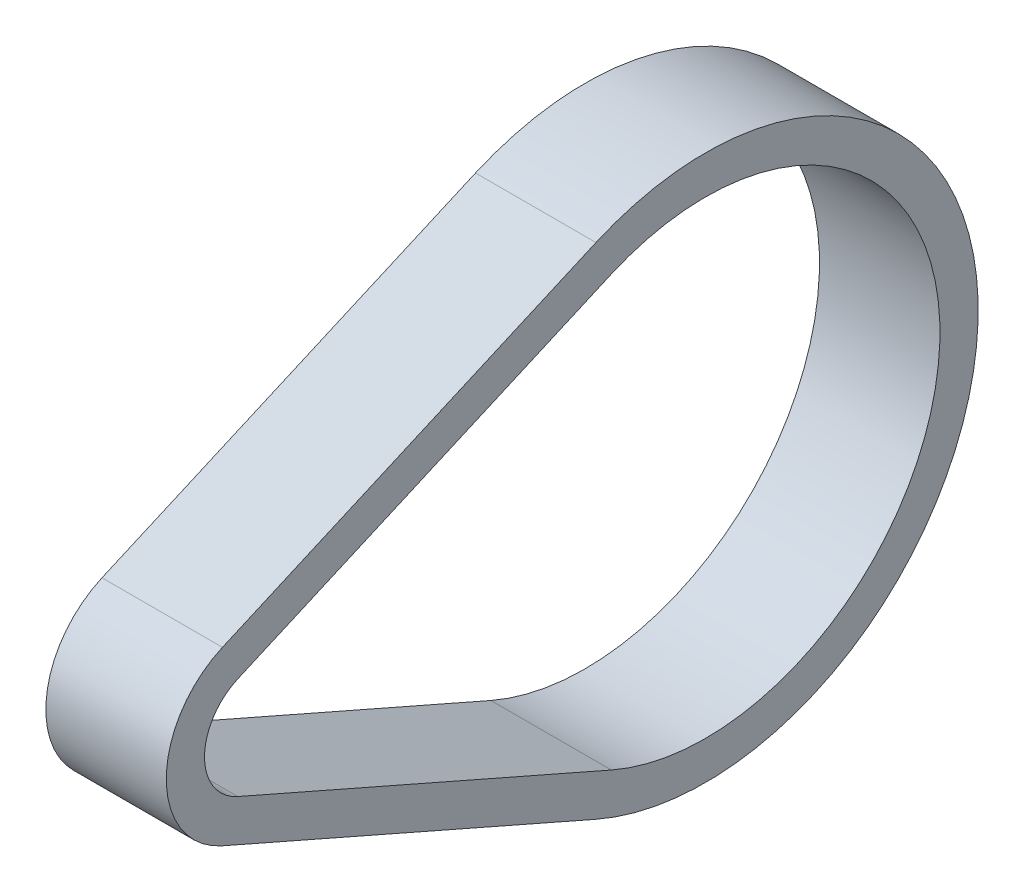
ISO-10303-21;
HEADER;
FILE_DESCRIPTION(('STEP AP214'),'2;1');
FILE_NAME('part.step','',(''),(''),'','','');
FILE_SCHEMA(('AUTOMOTIVE_DESIGN { 1 0 10303 214 1 1 1 1 }'));
ENDSEC;
DATA;
#1=APPLICATION_CONTEXT('core data for automotive mechanical design processes');
#2=APPLICATION_PROTOCOL_DEFINITION('international standard','automotive_design',2000,#1);
#3=PRODUCT_CONTEXT('',#1,'mechanical');
#4=PRODUCT('Part','Part','',(#3));
#5=PRODUCT_RELATED_PRODUCT_CATEGORY('part','',(#4));
#6=PRODUCT_DEFINITION_FORMATION('','',#4);
#7=PRODUCT_DEFINITION_CONTEXT('part definition',#1,'design');
#8=PRODUCT_DEFINITION('design','',#6,#7);
#9=PRODUCT_DEFINITION_SHAPE('','',#8);
#10=(LENGTH_UNIT() NAMED_UNIT(*) SI_UNIT(.MILLI.,.METRE.));
#11=(NAMED_UNIT(*) PLANE_ANGLE_UNIT() SI_UNIT($,.RADIAN.));
#12=(NAMED_UNIT(*) SI_UNIT($,.STERADIAN.) SOLID_ANGLE_UNIT());
#13=UNCERTAINTY_MEASURE_WITH_UNIT(LENGTH_MEASURE(1.E-05),#10,'distance_accuracy_value','');
#14=(GEOMETRIC_REPRESENTATION_CONTEXT(3) GLOBAL_UNCERTAINTY_ASSIGNED_CONTEXT((#13)) GLOBAL_UNIT_ASSIGNED_CONTEXT((#10,
#11,#12)) REPRESENTATION_CONTEXT('',''));
#15=CARTESIAN_POINT('',(0.,0.,0.));
#16=DIRECTION('',(0.,0.,1.));
#17=DIRECTION('',(1.,0.,0.));
#18=AXIS2_PLACEMENT_3D('',#15,#16,#17);
#19=CARTESIAN_POINT('',(7.5,0.,0.));
#20=DIRECTION('',(1.,0.,0.));
#21=DIRECTION('',(0.,0.,-1.));
#22=AXIS2_PLACEMENT_3D('',#19,#20,#21);
#23=PLANE('',#22);
#24=CARTESIAN_POINT('',(7.5,0.,0.));
#25=DIRECTION('',(1.,0.,0.));
#26=DIRECTION('',(0.,0.,-1.));
#27=AXIS2_PLACEMENT_3D('',#24,#25,#26);
#28=CIRCLE('',#27,11.68908);
#29=CARTESIAN_POINT('',(7.5,10.7050218549064,4.69436878955805));
#30=VERTEX_POINT('',#29);
#31=CARTESIAN_POINT('',(7.5,-10.7050218549064,4.69436878955805));
#32=VERTEX_POINT('',#31);
#33=EDGE_CURVE('E153',#30,#32,#28,.T.);
#34=ORIENTED_EDGE('',*,*,#33,.T.);
#35=DIRECTION('',(0.,-0.401602931073964,-0.91581389253101));
#36=VECTOR('',#35,1.);
#37=CARTESIAN_POINT('',(7.5,-10.7050218549064,4.69436878955805));
#38=LINE('',#37,#36);
#39=CARTESIAN_POINT('',(7.5,-31.1031827948616,-41.8215247098695));
#40=VERTEX_POINT('',#39);
#41=EDGE_CURVE('E157',#32,#40,#38,.T.);
#42=ORIENTED_EDGE('',*,*,#41,.T.);
#43=CARTESIAN_POINT('',(7.5,0.,-55.4609));
#44=DIRECTION('',(1.,0.,0.));
#45=DIRECTION('',(0.,0.,-1.));
#46=AXIS2_PLACEMENT_3D('',#43,#44,#45);
#47=CIRCLE('',#46,33.96234);
#48=CARTESIAN_POINT('',(7.5,31.1031827948616,-41.8215247098695));
#49=VERTEX_POINT('',#48);
#50=EDGE_CURVE('E161',#40,#49,#47,.T.);
#51=ORIENTED_EDGE('',*,*,#50,.T.);
#52=DIRECTION('',(0.,-0.401602931073964,0.91581389253101));
#53=VECTOR('',#52,1.);
#54=CARTESIAN_POINT('',(7.5,10.7050218549064,4.69436878955805));
#55=LINE('',#54,#53);
#56=EDGE_CURVE('E164',#49,#30,#55,.T.);
#57=ORIENTED_EDGE('',*,*,#56,.T.);
#58=EDGE_LOOP('',(#34,#42,#51,#57));
#59=FACE_BOUND('',#58,.T.);
#60=DIRECTION('',(0.,-0.401602931073964,-0.915813892531011));
#61=VECTOR('',#60,1.);
#62=CARTESIAN_POINT('',(7.5,-6.34345819172745,2.7817348303183));
#63=LINE('',#62,#61);
#64=CARTESIAN_POINT('',(7.5,-6.34345819172745,2.7817348303183));
#65=VERTEX_POINT('',#64);
#66=CARTESIAN_POINT('',(7.5,-26.7416191316827,-43.7341586691092));
#67=VERTEX_POINT('',#66);
#68=EDGE_CURVE('E114',#65,#67,#63,.T.);
#69=ORIENTED_EDGE('',*,*,#68,.F.);
#70=CARTESIAN_POINT('',(7.5,0.,0.));
#71=DIRECTION('',(1.,0.,0.));
#72=DIRECTION('',(0.,0.,-1.));
#73=AXIS2_PLACEMENT_3D('',#70,#71,#72);
#74=CIRCLE('',#73,6.92658);
#75=CARTESIAN_POINT('',(7.5,6.34345819172745,2.7817348303183));
#76=VERTEX_POINT('',#75);
#77=EDGE_CURVE('E105',#76,#65,#74,.T.);
#78=ORIENTED_EDGE('',*,*,#77,.F.);
#79=DIRECTION('',(0.,-0.401602931073963,0.915813892531011));
#80=VECTOR('',#79,1.);
#81=CARTESIAN_POINT('',(7.5,6.34345819172745,2.7817348303183));
#82=LINE('',#81,#80);
#83=CARTESIAN_POINT('',(7.5,26.7416191316827,-43.7341586691092));
#84=VERTEX_POINT('',#83);
#85=EDGE_CURVE('E131',#84,#76,#82,.T.);
#86=ORIENTED_EDGE('',*,*,#85,.F.);
#87=CARTESIAN_POINT('',(7.5,0.,-55.4609));
#88=DIRECTION('',(1.,0.,0.));
#89=DIRECTION('',(0.,0.,-1.));
#90=AXIS2_PLACEMENT_3D('',#87,#88,#89);
#91=CIRCLE('',#90,29.19984);
#92=EDGE_CURVE('E127',#67,#84,#91,.T.);
#93=ORIENTED_EDGE('',*,*,#92,.F.);
#94=EDGE_LOOP('',(#69,#78,#86,#93));
#95=FACE_BOUND('',#94,.T.);
#96=ADVANCED_FACE('F39',(#59,#95),#23,.T.);
#97=CARTESIAN_POINT('',(-7.5,0.,0.));
#98=DIRECTION('',(1.,0.,0.));
#99=DIRECTION('',(0.,0.,-1.));
#100=AXIS2_PLACEMENT_3D('',#97,#98,#99);
#101=PLANE('',#100);
#102=CARTESIAN_POINT('',(-7.5,0.,0.));
#103=DIRECTION('',(1.,0.,0.));
#104=DIRECTION('',(0.,0.,-1.));
#105=AXIS2_PLACEMENT_3D('',#102,#103,#104);
#106=CIRCLE('',#105,11.68908);
#107=CARTESIAN_POINT('',(-7.5,10.7050218549064,4.69436878955805));
#108=VERTEX_POINT('',#107);
#109=CARTESIAN_POINT('',(-7.5,-10.7050218549064,4.69436878955805));
#110=VERTEX_POINT('',#109);
#111=EDGE_CURVE('E123',#108,#110,#106,.T.);
#112=ORIENTED_EDGE('',*,*,#111,.F.);
#113=DIRECTION('',(0.,-0.401602931073964,0.91581389253101));
#114=VECTOR('',#113,1.);
#115=CARTESIAN_POINT('',(-7.5,10.7050218549064,4.69436878955805));
#116=LINE('',#115,#114);
#117=CARTESIAN_POINT('',(-7.5,31.1031827948616,-41.8215247098695));
#118=VERTEX_POINT('',#117);
#119=EDGE_CURVE('E158',#118,#108,#116,.T.);
#120=ORIENTED_EDGE('',*,*,#119,.F.);
#121=CARTESIAN_POINT('',(-7.5,0.,-55.4609));
#122=DIRECTION('',(1.,0.,0.));
#123=DIRECTION('',(0.,0.,-1.));
#124=AXIS2_PLACEMENT_3D('',#121,#122,#123);
#125=CIRCLE('',#124,33.96234);
#126=CARTESIAN_POINT('',(-7.5,-31.1031827948616,-41.8215247098695));
#127=VERTEX_POINT('',#126);
#128=EDGE_CURVE('E174',#127,#118,#125,.T.);
#129=ORIENTED_EDGE('',*,*,#128,.F.);
#130=DIRECTION('',(0.,-0.401602931073964,-0.91581389253101));
#131=VECTOR('',#130,1.);
#132=CARTESIAN_POINT('',(-7.5,-10.7050218549064,4.69436878955805));
#133=LINE('',#132,#131);
#134=EDGE_CURVE('E171',#110,#127,#133,.T.);
#135=ORIENTED_EDGE('',*,*,#134,.F.);
#136=EDGE_LOOP('',(#112,#120,#129,#135));
#137=FACE_BOUND('',#136,.T.);
#138=CARTESIAN_POINT('',(-7.5,0.,0.));
#139=DIRECTION('',(1.,0.,0.));
#140=DIRECTION('',(0.,0.,-1.));
#141=AXIS2_PLACEMENT_3D('',#138,#139,#140);
#142=CIRCLE('',#141,6.92658);
#143=CARTESIAN_POINT('',(-7.5,6.34345819172745,2.7817348303183));
#144=VERTEX_POINT('',#143);
#145=CARTESIAN_POINT('',(-7.5,-6.34345819172745,2.7817348303183));
#146=VERTEX_POINT('',#145);
#147=EDGE_CURVE('E63',#144,#146,#142,.T.);
#148=ORIENTED_EDGE('',*,*,#147,.T.);
#149=DIRECTION('',(0.,-0.401602931073964,-0.915813892531011));
#150=VECTOR('',#149,1.);
#151=CARTESIAN_POINT('',(-7.5,-6.34345819172745,2.7817348303183));
#152=LINE('',#151,#150);
#153=CARTESIAN_POINT('',(-7.5,-26.7416191316827,-43.7341586691092));
#154=VERTEX_POINT('',#153);
#155=EDGE_CURVE('E121',#146,#154,#152,.T.);
#156=ORIENTED_EDGE('',*,*,#155,.T.);
#157=CARTESIAN_POINT('',(-7.5,0.,-55.4609));
#158=DIRECTION('',(1.,0.,0.));
#159=DIRECTION('',(0.,0.,-1.));
#160=AXIS2_PLACEMENT_3D('',#157,#158,#159);
#161=CIRCLE('',#160,29.19984);
#162=CARTESIAN_POINT('',(-7.5,26.7416191316827,-43.7341586691092));
#163=VERTEX_POINT('',#162);
#164=EDGE_CURVE('E140',#154,#163,#161,.T.);
#165=ORIENTED_EDGE('',*,*,#164,.T.);
#166=DIRECTION('',(0.,-0.401602931073963,0.915813892531011));
#167=VECTOR('',#166,1.);
#168=CARTESIAN_POINT('',(-7.5,6.34345819172745,2.7817348303183));
#169=LINE('',#168,#167);
#170=EDGE_CURVE('E115',#163,#144,#169,.T.);
#171=ORIENTED_EDGE('',*,*,#170,.T.);
#172=EDGE_LOOP('',(#148,#156,#165,#171));
#173=FACE_BOUND('',#172,.T.);
#174=ADVANCED_FACE('F197',(#137,#173),#101,.F.);
#175=CARTESIAN_POINT('',(7.5,0.,0.));
#176=DIRECTION('',(-1.,0.,0.));
#177=DIRECTION('',(0.,0.,1.));
#178=AXIS2_PLACEMENT_3D('',#175,#176,#177);
#179=CYLINDRICAL_SURFACE('',#178,11.68908);
#180=ORIENTED_EDGE('',*,*,#111,.T.);
#181=DIRECTION('',(-1.,0.,0.));
#182=VECTOR('',#181,1.);
#183=CARTESIAN_POINT('',(7.5,-10.7050218549064,4.69436878955805));
#184=LINE('',#183,#182);
#185=EDGE_CURVE('E11',#32,#110,#184,.T.);
#186=ORIENTED_EDGE('',*,*,#185,.F.);
#187=ORIENTED_EDGE('',*,*,#33,.F.);
#188=DIRECTION('',(-1.,0.,0.));
#189=VECTOR('',#188,1.);
#190=CARTESIAN_POINT('',(7.5,10.7050218549064,4.69436878955805));
#191=LINE('',#190,#189);
#192=EDGE_CURVE('E167',#30,#108,#191,.T.);
#193=ORIENTED_EDGE('',*,*,#192,.T.);
#194=EDGE_LOOP('',(#180,#186,#187,#193));
#195=FACE_BOUND('',#194,.T.);
#196=ADVANCED_FACE('F41',(#195),#179,.T.);
#197=CARTESIAN_POINT('',(7.5,-10.7050218549064,4.69436878955805));
#198=DIRECTION('',(0.,0.91581389253101,-0.401602931073964));
#199=DIRECTION('',(0.,0.401602931073964,0.91581389253101));
#200=AXIS2_PLACEMENT_3D('',#197,#198,#199);
#201=PLANE('',#200);
#202=ORIENTED_EDGE('',*,*,#134,.T.);
#203=DIRECTION('',(-1.,0.,0.));
#204=VECTOR('',#203,1.);
#205=CARTESIAN_POINT('',(7.5,-31.1031827948616,-41.8215247098695));
#206=LINE('',#205,#204);
#207=EDGE_CURVE('E48',#40,#127,#206,.T.);
#208=ORIENTED_EDGE('',*,*,#207,.F.);
#209=ORIENTED_EDGE('',*,*,#41,.F.);
#210=ORIENTED_EDGE('',*,*,#185,.T.);
#211=EDGE_LOOP('',(#202,#208,#209,#210));
#212=FACE_BOUND('',#211,.T.);
#213=ADVANCED_FACE('F207',(#212),#201,.F.);
#214=CARTESIAN_POINT('',(7.5,0.,-55.4609));
#215=DIRECTION('',(-1.,0.,0.));
#216=DIRECTION('',(0.,0.,1.));
#217=AXIS2_PLACEMENT_3D('',#214,#215,#216);
#218=CYLINDRICAL_SURFACE('',#217,33.96234);
#219=ORIENTED_EDGE('',*,*,#128,.T.);
#220=DIRECTION('',(-1.,0.,0.));
#221=VECTOR('',#220,1.);
#222=CARTESIAN_POINT('',(7.5,31.1031827948616,-41.8215247098695));
#223=LINE('',#222,#221);
#224=EDGE_CURVE('E182',#49,#118,#223,.T.);
#225=ORIENTED_EDGE('',*,*,#224,.F.);
#226=ORIENTED_EDGE('',*,*,#50,.F.);
#227=ORIENTED_EDGE('',*,*,#207,.T.);
#228=EDGE_LOOP('',(#219,#225,#226,#227));
#229=FACE_BOUND('',#228,.T.);
#230=ADVANCED_FACE('F191',(#229),#218,.T.);
#231=CARTESIAN_POINT('',(7.5,10.7050218549064,4.69436878955805));
#232=DIRECTION('',(0.,-0.91581389253101,-0.401602931073964));
#233=DIRECTION('',(0.,0.401602931073964,-0.91581389253101));
#234=AXIS2_PLACEMENT_3D('',#231,#232,#233);
#235=PLANE('',#234);
#236=ORIENTED_EDGE('',*,*,#119,.T.);
#237=ORIENTED_EDGE('',*,*,#192,.F.);
#238=ORIENTED_EDGE('',*,*,#56,.F.);
#239=ORIENTED_EDGE('',*,*,#224,.T.);
#240=EDGE_LOOP('',(#236,#237,#238,#239));
#241=FACE_BOUND('',#240,.T.);
#242=ADVANCED_FACE('F201',(#241),#235,.F.);
#243=CARTESIAN_POINT('',(7.5,0.,0.));
#244=DIRECTION('',(-1.,0.,0.));
#245=DIRECTION('',(0.,0.,1.));
#246=AXIS2_PLACEMENT_3D('',#243,#244,#245);
#247=CYLINDRICAL_SURFACE('',#246,6.92658);
#248=ORIENTED_EDGE('',*,*,#147,.F.);
#249=DIRECTION('',(-1.,0.,0.));
#250=VECTOR('',#249,1.);
#251=CARTESIAN_POINT('',(7.5,6.34345819172745,2.7817348303183));
#252=LINE('',#251,#250);
#253=EDGE_CURVE('E109',#76,#144,#252,.T.);
#254=ORIENTED_EDGE('',*,*,#253,.F.);
#255=ORIENTED_EDGE('',*,*,#77,.T.);
#256=DIRECTION('',(-1.,0.,0.));
#257=VECTOR('',#256,1.);
#258=CARTESIAN_POINT('',(7.5,-6.34345819172745,2.7817348303183));
#259=LINE('',#258,#257);
#260=EDGE_CURVE('E108',#65,#146,#259,.T.);
#261=ORIENTED_EDGE('',*,*,#260,.T.);
#262=EDGE_LOOP('',(#248,#254,#255,#261));
#263=FACE_BOUND('',#262,.T.);
#264=ADVANCED_FACE('F107',(#263),#247,.F.);
#265=CARTESIAN_POINT('',(7.5,-6.34345819172745,2.7817348303183));
#266=DIRECTION('',(0.,0.91581389253101,-0.401602931073964));
#267=DIRECTION('',(0.,0.401602931073964,0.915813892531011));
#268=AXIS2_PLACEMENT_3D('',#265,#266,#267);
#269=PLANE('',#268);
#270=ORIENTED_EDGE('',*,*,#155,.F.);
#271=ORIENTED_EDGE('',*,*,#260,.F.);
#272=ORIENTED_EDGE('',*,*,#68,.T.);
#273=DIRECTION('',(-1.,0.,0.));
#274=VECTOR('',#273,1.);
#275=CARTESIAN_POINT('',(7.5,-26.7416191316827,-43.7341586691092));
#276=LINE('',#275,#274);
#277=EDGE_CURVE('E124',#67,#154,#276,.T.);
#278=ORIENTED_EDGE('',*,*,#277,.T.);
#279=EDGE_LOOP('',(#270,#271,#272,#278));
#280=FACE_BOUND('',#279,.T.);
#281=ADVANCED_FACE('F118',(#280),#269,.T.);
#282=CARTESIAN_POINT('',(7.5,0.,-55.4609));
#283=DIRECTION('',(-1.,0.,0.));
#284=DIRECTION('',(0.,0.,1.));
#285=AXIS2_PLACEMENT_3D('',#282,#283,#284);
#286=CYLINDRICAL_SURFACE('',#285,29.19984);
#287=ORIENTED_EDGE('',*,*,#164,.F.);
#288=ORIENTED_EDGE('',*,*,#277,.F.);
#289=ORIENTED_EDGE('',*,*,#92,.T.);
#290=DIRECTION('',(-1.,0.,0.));
#291=VECTOR('',#290,1.);
#292=CARTESIAN_POINT('',(7.5,26.7416191316827,-43.7341586691092));
#293=LINE('',#292,#291);
#294=EDGE_CURVE('E55',#84,#163,#293,.T.);
#295=ORIENTED_EDGE('',*,*,#294,.T.);
#296=EDGE_LOOP('',(#287,#288,#289,#295));
#297=FACE_BOUND('',#296,.T.);
#298=ADVANCED_FACE('F230',(#297),#286,.F.);
#299=CARTESIAN_POINT('',(7.5,6.34345819172745,2.7817348303183));
#300=DIRECTION('',(0.,-0.915813892531011,-0.401602931073963));
#301=DIRECTION('',(0.,0.401602931073964,-0.915813892531011));
#302=AXIS2_PLACEMENT_3D('',#299,#300,#301);
#303=PLANE('',#302);
#304=ORIENTED_EDGE('',*,*,#170,.F.);
#305=ORIENTED_EDGE('',*,*,#294,.F.);
#306=ORIENTED_EDGE('',*,*,#85,.T.);
#307=ORIENTED_EDGE('',*,*,#253,.T.);
#308=EDGE_LOOP('',(#304,#305,#306,#307));
#309=FACE_BOUND('',#308,.T.);
#310=ADVANCED_FACE('F234',(#309),#303,.T.);
#311=CLOSED_SHELL('',(#96,#174,#196,#213,#230,#242,#264,#281,#298,#310));
#312=MANIFOLD_SOLID_BREP('B2',#311);
#313=ADVANCED_BREP_SHAPE_REPRESENTATION('',(#18,#312),#14);
#314=SHAPE_DEFINITION_REPRESENTATION(#9,#313);
ENDSEC;
END-ISO-10303-21;
